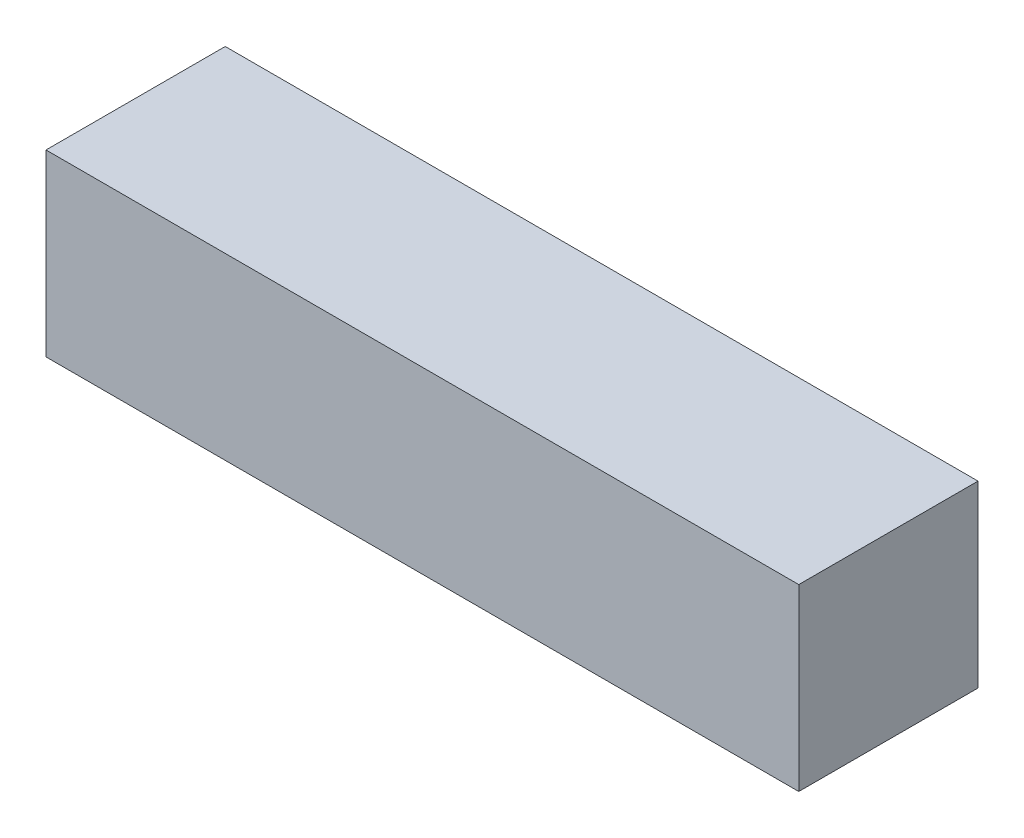
ISO-10303-21;
HEADER;
FILE_DESCRIPTION(('STEP AP214'),'2;1');
FILE_NAME('part.step','',(''),(''),'','','');
FILE_SCHEMA(('AUTOMOTIVE_DESIGN { 1 0 10303 214 1 1 1 1 }'));
ENDSEC;
DATA;
#1=APPLICATION_CONTEXT('core data for automotive mechanical design processes');
#2=APPLICATION_PROTOCOL_DEFINITION('international standard','automotive_design',2000,#1);
#3=PRODUCT_CONTEXT('',#1,'mechanical');
#4=PRODUCT('Part','Part','',(#3));
#5=PRODUCT_RELATED_PRODUCT_CATEGORY('part','',(#4));
#6=PRODUCT_DEFINITION_FORMATION('','',#4);
#7=PRODUCT_DEFINITION_CONTEXT('part definition',#1,'design');
#8=PRODUCT_DEFINITION('design','',#6,#7);
#9=PRODUCT_DEFINITION_SHAPE('','',#8);
#10=(LENGTH_UNIT() NAMED_UNIT(*) SI_UNIT(.MILLI.,.METRE.));
#11=(NAMED_UNIT(*) PLANE_ANGLE_UNIT() SI_UNIT($,.RADIAN.));
#12=(NAMED_UNIT(*) SI_UNIT($,.STERADIAN.) SOLID_ANGLE_UNIT());
#13=UNCERTAINTY_MEASURE_WITH_UNIT(LENGTH_MEASURE(1.E-05),#10,'distance_accuracy_value','');
#14=(GEOMETRIC_REPRESENTATION_CONTEXT(3) GLOBAL_UNCERTAINTY_ASSIGNED_CONTEXT((#13)) GLOBAL_UNIT_ASSIGNED_CONTEXT((#10,
#11,#12)) REPRESENTATION_CONTEXT('',''));
#15=CARTESIAN_POINT('',(0.,0.,0.));
#16=DIRECTION('',(0.,0.,1.));
#17=DIRECTION('',(1.,0.,0.));
#18=AXIS2_PLACEMENT_3D('',#15,#16,#17);
#19=CARTESIAN_POINT('',(-24.0943043801565,8.21370967741936,10.));
#20=DIRECTION('',(1.,0.,0.));
#21=DIRECTION('',(0.,1.,0.));
#22=AXIS2_PLACEMENT_3D('',#19,#20,#21);
#23=PLANE('',#22);
#24=DIRECTION('',(0.,-1.,0.));
#25=VECTOR('',#24,1.);
#26=CARTESIAN_POINT('',(-24.0943043801565,8.21370967741936,0.));
#27=LINE('',#26,#25);
#28=CARTESIAN_POINT('',(-24.0943043801565,8.21370967741936,0.));
#29=VERTEX_POINT('',#28);
#30=CARTESIAN_POINT('',(-24.0943043801565,-1.78629032258064,0.));
#31=VERTEX_POINT('',#30);
#32=EDGE_CURVE('E107',#29,#31,#27,.T.);
#33=ORIENTED_EDGE('',*,*,#32,.T.);
#34=DIRECTION('',(0.,0.,-1.));
#35=VECTOR('',#34,1.);
#36=CARTESIAN_POINT('',(-24.0943043801565,-1.78629032258064,10.));
#37=LINE('',#36,#35);
#38=CARTESIAN_POINT('',(-24.0943043801565,-1.78629032258064,10.));
#39=VERTEX_POINT('',#38);
#40=EDGE_CURVE('E11',#39,#31,#37,.T.);
#41=ORIENTED_EDGE('',*,*,#40,.F.);
#42=DIRECTION('',(0.,-1.,0.));
#43=VECTOR('',#42,1.);
#44=CARTESIAN_POINT('',(-24.0943043801565,8.21370967741936,10.));
#45=LINE('',#44,#43);
#46=CARTESIAN_POINT('',(-24.0943043801565,8.21370967741936,10.));
#47=VERTEX_POINT('',#46);
#48=EDGE_CURVE('E91',#47,#39,#45,.T.);
#49=ORIENTED_EDGE('',*,*,#48,.F.);
#50=DIRECTION('',(0.,0.,-1.));
#51=VECTOR('',#50,1.);
#52=CARTESIAN_POINT('',(-24.0943043801565,8.21370967741936,10.));
#53=LINE('',#52,#51);
#54=EDGE_CURVE('E103',#47,#29,#53,.T.);
#55=ORIENTED_EDGE('',*,*,#54,.T.);
#56=EDGE_LOOP('',(#33,#41,#49,#55));
#57=FACE_BOUND('',#56,.T.);
#58=ADVANCED_FACE('F39',(#57),#23,.F.);
#59=CARTESIAN_POINT('',(-24.0943043801565,-1.78629032258064,10.));
#60=DIRECTION('',(0.,1.,0.));
#61=DIRECTION('',(0.,0.,1.));
#62=AXIS2_PLACEMENT_3D('',#59,#60,#61);
#63=PLANE('',#62);
#64=DIRECTION('',(1.,0.,0.));
#65=VECTOR('',#64,1.);
#66=CARTESIAN_POINT('',(-24.0943043801565,-1.78629032258064,0.));
#67=LINE('',#66,#65);
#68=CARTESIAN_POINT('',(17.9056956198435,-1.78629032258064,0.));
#69=VERTEX_POINT('',#68);
#70=EDGE_CURVE('E96',#31,#69,#67,.T.);
#71=ORIENTED_EDGE('',*,*,#70,.T.);
#72=DIRECTION('',(0.,0.,-1.));
#73=VECTOR('',#72,1.);
#74=CARTESIAN_POINT('',(17.9056956198435,-1.78629032258064,10.));
#75=LINE('',#74,#73);
#76=CARTESIAN_POINT('',(17.9056956198435,-1.78629032258064,10.));
#77=VERTEX_POINT('',#76);
#78=EDGE_CURVE('E48',#77,#69,#75,.T.);
#79=ORIENTED_EDGE('',*,*,#78,.F.);
#80=DIRECTION('',(1.,0.,0.));
#81=VECTOR('',#80,1.);
#82=CARTESIAN_POINT('',(-24.0943043801565,-1.78629032258064,10.));
#83=LINE('',#82,#81);
#84=EDGE_CURVE('E86',#39,#77,#83,.T.);
#85=ORIENTED_EDGE('',*,*,#84,.F.);
#86=ORIENTED_EDGE('',*,*,#40,.T.);
#87=EDGE_LOOP('',(#71,#79,#85,#86));
#88=FACE_BOUND('',#87,.T.);
#89=ADVANCED_FACE('F95',(#88),#63,.F.);
#90=CARTESIAN_POINT('',(17.9056956198435,8.21370967741936,10.));
#91=DIRECTION('',(-1.,0.,0.));
#92=DIRECTION('',(0.,0.,1.));
#93=AXIS2_PLACEMENT_3D('',#90,#91,#92);
#94=PLANE('',#93);
#95=DIRECTION('',(0.,1.,0.));
#96=VECTOR('',#95,1.);
#97=CARTESIAN_POINT('',(17.9056956198435,8.21370967741936,0.));
#98=LINE('',#97,#96);
#99=CARTESIAN_POINT('',(17.9056956198435,8.21370967741936,0.));
#100=VERTEX_POINT('',#99);
#101=EDGE_CURVE('E73',#69,#100,#98,.T.);
#102=ORIENTED_EDGE('',*,*,#101,.T.);
#103=DIRECTION('',(0.,0.,-1.));
#104=VECTOR('',#103,1.);
#105=CARTESIAN_POINT('',(17.9056956198435,8.21370967741936,10.));
#106=LINE('',#105,#104);
#107=CARTESIAN_POINT('',(17.9056956198435,8.21370967741936,10.));
#108=VERTEX_POINT('',#107);
#109=EDGE_CURVE('E98',#108,#100,#106,.T.);
#110=ORIENTED_EDGE('',*,*,#109,.F.);
#111=DIRECTION('',(0.,1.,0.));
#112=VECTOR('',#111,1.);
#113=CARTESIAN_POINT('',(17.9056956198435,8.21370967741936,10.));
#114=LINE('',#113,#112);
#115=EDGE_CURVE('E89',#77,#108,#114,.T.);
#116=ORIENTED_EDGE('',*,*,#115,.F.);
#117=ORIENTED_EDGE('',*,*,#78,.T.);
#118=EDGE_LOOP('',(#102,#110,#116,#117));
#119=FACE_BOUND('',#118,.T.);
#120=ADVANCED_FACE('F99',(#119),#94,.F.);
#121=CARTESIAN_POINT('',(-24.0943043801565,8.21370967741936,10.));
#122=DIRECTION('',(0.,-1.,0.));
#123=DIRECTION('',(0.,0.,-1.));
#124=AXIS2_PLACEMENT_3D('',#121,#122,#123);
#125=PLANE('',#124);
#126=DIRECTION('',(-1.,0.,0.));
#127=VECTOR('',#126,1.);
#128=CARTESIAN_POINT('',(-24.0943043801565,8.21370967741936,0.));
#129=LINE('',#128,#127);
#130=EDGE_CURVE('E79',#100,#29,#129,.T.);
#131=ORIENTED_EDGE('',*,*,#130,.T.);
#132=ORIENTED_EDGE('',*,*,#54,.F.);
#133=DIRECTION('',(-1.,0.,0.));
#134=VECTOR('',#133,1.);
#135=CARTESIAN_POINT('',(-24.0943043801565,8.21370967741936,10.));
#136=LINE('',#135,#134);
#137=EDGE_CURVE('E56',#108,#47,#136,.T.);
#138=ORIENTED_EDGE('',*,*,#137,.F.);
#139=ORIENTED_EDGE('',*,*,#109,.T.);
#140=EDGE_LOOP('',(#131,#132,#138,#139));
#141=FACE_BOUND('',#140,.T.);
#142=ADVANCED_FACE('F120',(#141),#125,.F.);
#143=CARTESIAN_POINT('',(0.,0.,10.));
#144=DIRECTION('',(0.,0.,1.));
#145=DIRECTION('',(1.,0.,0.));
#146=AXIS2_PLACEMENT_3D('',#143,#144,#145);
#147=PLANE('',#146);
#148=ORIENTED_EDGE('',*,*,#48,.T.);
#149=ORIENTED_EDGE('',*,*,#84,.T.);
#150=ORIENTED_EDGE('',*,*,#115,.T.);
#151=ORIENTED_EDGE('',*,*,#137,.T.);
#152=EDGE_LOOP('',(#148,#149,#150,#151));
#153=FACE_BOUND('',#152,.T.);
#154=ADVANCED_FACE('F87',(#153),#147,.T.);
#155=CARTESIAN_POINT('',(0.,0.,0.));
#156=DIRECTION('',(0.,0.,1.));
#157=DIRECTION('',(1.,0.,0.));
#158=AXIS2_PLACEMENT_3D('',#155,#156,#157);
#159=PLANE('',#158);
#160=ORIENTED_EDGE('',*,*,#32,.F.);
#161=ORIENTED_EDGE('',*,*,#130,.F.);
#162=ORIENTED_EDGE('',*,*,#101,.F.);
#163=ORIENTED_EDGE('',*,*,#70,.F.);
#164=EDGE_LOOP('',(#160,#161,#162,#163));
#165=FACE_BOUND('',#164,.T.);
#166=ADVANCED_FACE('F123',(#165),#159,.F.);
#167=CLOSED_SHELL('',(#58,#89,#120,#142,#154,#166));
#168=MANIFOLD_SOLID_BREP('B2',#167);
#169=ADVANCED_BREP_SHAPE_REPRESENTATION('',(#18,#168),#14);
#170=SHAPE_DEFINITION_REPRESENTATION(#9,#169);
ENDSEC;
END-ISO-10303-21;
